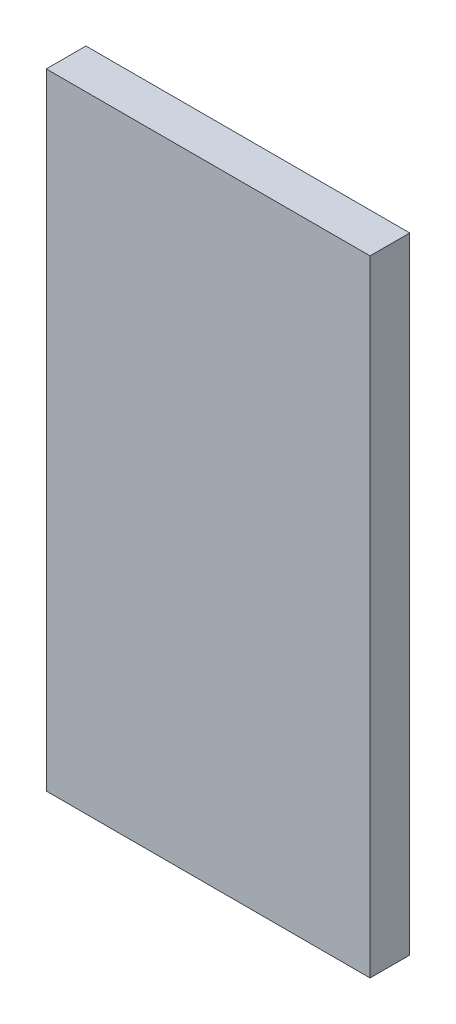
ISO-10303-21;
HEADER;
FILE_DESCRIPTION(('STEP AP214'),'2;1');
FILE_NAME('part.step','',(''),(''),'','','');
FILE_SCHEMA(('AUTOMOTIVE_DESIGN { 1 0 10303 214 1 1 1 1 }'));
ENDSEC;
DATA;
#1=APPLICATION_CONTEXT('core data for automotive mechanical design processes');
#2=APPLICATION_PROTOCOL_DEFINITION('international standard','automotive_design',2000,#1);
#3=PRODUCT_CONTEXT('',#1,'mechanical');
#4=PRODUCT('Part','Part','',(#3));
#5=PRODUCT_RELATED_PRODUCT_CATEGORY('part','',(#4));
#6=PRODUCT_DEFINITION_FORMATION('','',#4);
#7=PRODUCT_DEFINITION_CONTEXT('part definition',#1,'design');
#8=PRODUCT_DEFINITION('design','',#6,#7);
#9=PRODUCT_DEFINITION_SHAPE('','',#8);
#10=(LENGTH_UNIT() NAMED_UNIT(*) SI_UNIT(.MILLI.,.METRE.));
#11=(NAMED_UNIT(*) PLANE_ANGLE_UNIT() SI_UNIT($,.RADIAN.));
#12=(NAMED_UNIT(*) SI_UNIT($,.STERADIAN.) SOLID_ANGLE_UNIT());
#13=UNCERTAINTY_MEASURE_WITH_UNIT(LENGTH_MEASURE(1.E-05),#10,'distance_accuracy_value','');
#14=(GEOMETRIC_REPRESENTATION_CONTEXT(3) GLOBAL_UNCERTAINTY_ASSIGNED_CONTEXT((#13)) GLOBAL_UNIT_ASSIGNED_CONTEXT((#10,
#11,#12)) REPRESENTATION_CONTEXT('',''));
#15=CARTESIAN_POINT('',(0.,0.,0.));
#16=DIRECTION('',(0.,0.,1.));
#17=DIRECTION('',(1.,0.,0.));
#18=AXIS2_PLACEMENT_3D('',#15,#16,#17);
#19=CARTESIAN_POINT('',(-0.408,2.122,0.1));
#20=DIRECTION('',(0.,0.,1.));
#21=DIRECTION('',(1.,0.,0.));
#22=AXIS2_PLACEMENT_3D('',#19,#20,#21);
#23=PLANE('',#22);
#24=DIRECTION('',(0.,1.,0.));
#25=VECTOR('',#24,1.);
#26=CARTESIAN_POINT('',(0.408,2.122,0.1));
#27=LINE('',#26,#25);
#28=CARTESIAN_POINT('',(0.408,3.698,0.1));
#29=VERTEX_POINT('',#28);
#30=CARTESIAN_POINT('',(0.408,2.122,0.1));
#31=VERTEX_POINT('',#30);
#32=EDGE_CURVE('E75',#29,#31,#27,.F.);
#33=ORIENTED_EDGE('',*,*,#32,.F.);
#34=DIRECTION('',(1.,0.,0.));
#35=VECTOR('',#34,1.);
#36=CARTESIAN_POINT('',(-0.408,3.698,0.1));
#37=LINE('',#36,#35);
#38=CARTESIAN_POINT('',(-0.408,3.698,0.1));
#39=VERTEX_POINT('',#38);
#40=EDGE_CURVE('E57',#39,#29,#37,.T.);
#41=ORIENTED_EDGE('',*,*,#40,.F.);
#42=DIRECTION('',(0.,1.,0.));
#43=VECTOR('',#42,1.);
#44=CARTESIAN_POINT('',(-0.408,2.122,0.1));
#45=LINE('',#44,#43);
#46=CARTESIAN_POINT('',(-0.408,2.122,0.1));
#47=VERTEX_POINT('',#46);
#48=EDGE_CURVE('E19',#39,#47,#45,.F.);
#49=ORIENTED_EDGE('',*,*,#48,.T.);
#50=DIRECTION('',(1.,0.,0.));
#51=VECTOR('',#50,1.);
#52=CARTESIAN_POINT('',(-0.408,2.122,0.1));
#53=LINE('',#52,#51);
#54=EDGE_CURVE('E54',#47,#31,#53,.T.);
#55=ORIENTED_EDGE('',*,*,#54,.T.);
#56=EDGE_LOOP('',(#33,#41,#49,#55));
#57=FACE_BOUND('',#56,.T.);
#58=ADVANCED_FACE('F16',(#57),#23,.T.);
#59=CARTESIAN_POINT('',(-0.408,2.122,0.));
#60=DIRECTION('',(1.,0.,0.));
#61=DIRECTION('',(0.,0.,-1.));
#62=AXIS2_PLACEMENT_3D('',#59,#60,#61);
#63=PLANE('',#62);
#64=DIRECTION('',(0.,0.,1.));
#65=VECTOR('',#64,1.);
#66=CARTESIAN_POINT('',(-0.408,3.698,0.));
#67=LINE('',#66,#65);
#68=CARTESIAN_POINT('',(-0.408,3.698,0.));
#69=VERTEX_POINT('',#68);
#70=EDGE_CURVE('E77',#69,#39,#67,.T.);
#71=ORIENTED_EDGE('',*,*,#70,.F.);
#72=DIRECTION('',(0.,1.,0.));
#73=VECTOR('',#72,1.);
#74=CARTESIAN_POINT('',(-0.408,2.122,0.));
#75=LINE('',#74,#73);
#76=CARTESIAN_POINT('',(-0.408,2.122,0.));
#77=VERTEX_POINT('',#76);
#78=EDGE_CURVE('E72',#69,#77,#75,.F.);
#79=ORIENTED_EDGE('',*,*,#78,.T.);
#80=DIRECTION('',(0.,0.,1.));
#81=VECTOR('',#80,1.);
#82=CARTESIAN_POINT('',(-0.408,2.122,0.));
#83=LINE('',#82,#81);
#84=EDGE_CURVE('E62',#77,#47,#83,.T.);
#85=ORIENTED_EDGE('',*,*,#84,.T.);
#86=ORIENTED_EDGE('',*,*,#48,.F.);
#87=EDGE_LOOP('',(#71,#79,#85,#86));
#88=FACE_BOUND('',#87,.T.);
#89=ADVANCED_FACE('F71',(#88),#63,.F.);
#90=CARTESIAN_POINT('',(-0.408,2.122,0.));
#91=DIRECTION('',(0.,1.,0.));
#92=DIRECTION('',(0.,0.,1.));
#93=AXIS2_PLACEMENT_3D('',#90,#91,#92);
#94=PLANE('',#93);
#95=ORIENTED_EDGE('',*,*,#54,.F.);
#96=ORIENTED_EDGE('',*,*,#84,.F.);
#97=DIRECTION('',(1.,0.,0.));
#98=VECTOR('',#97,1.);
#99=CARTESIAN_POINT('',(-0.408,2.122,0.));
#100=LINE('',#99,#98);
#101=CARTESIAN_POINT('',(0.408,2.122,0.));
#102=VERTEX_POINT('',#101);
#103=EDGE_CURVE('E82',#77,#102,#100,.T.);
#104=ORIENTED_EDGE('',*,*,#103,.T.);
#105=DIRECTION('',(0.,0.,-1.));
#106=VECTOR('',#105,1.);
#107=CARTESIAN_POINT('',(0.408,2.122,0.));
#108=LINE('',#107,#106);
#109=EDGE_CURVE('E68',#31,#102,#108,.T.);
#110=ORIENTED_EDGE('',*,*,#109,.F.);
#111=EDGE_LOOP('',(#95,#96,#104,#110));
#112=FACE_BOUND('',#111,.T.);
#113=ADVANCED_FACE('F65',(#112),#94,.F.);
#114=CARTESIAN_POINT('',(0.408,2.122,0.));
#115=DIRECTION('',(1.,0.,0.));
#116=DIRECTION('',(0.,0.,-1.));
#117=AXIS2_PLACEMENT_3D('',#114,#115,#116);
#118=PLANE('',#117);
#119=DIRECTION('',(0.,0.,1.));
#120=VECTOR('',#119,1.);
#121=CARTESIAN_POINT('',(0.408,3.698,0.));
#122=LINE('',#121,#120);
#123=CARTESIAN_POINT('',(0.408,3.698,0.));
#124=VERTEX_POINT('',#123);
#125=EDGE_CURVE('E33',#29,#124,#122,.F.);
#126=ORIENTED_EDGE('',*,*,#125,.F.);
#127=ORIENTED_EDGE('',*,*,#32,.T.);
#128=ORIENTED_EDGE('',*,*,#109,.T.);
#129=DIRECTION('',(0.,1.,0.));
#130=VECTOR('',#129,1.);
#131=CARTESIAN_POINT('',(0.408,2.122,0.));
#132=LINE('',#131,#130);
#133=EDGE_CURVE('E25',#102,#124,#132,.T.);
#134=ORIENTED_EDGE('',*,*,#133,.T.);
#135=EDGE_LOOP('',(#126,#127,#128,#134));
#136=FACE_BOUND('',#135,.T.);
#137=ADVANCED_FACE('F87',(#136),#118,.T.);
#138=CARTESIAN_POINT('',(-0.408,3.698,0.));
#139=DIRECTION('',(0.,1.,0.));
#140=DIRECTION('',(0.,0.,1.));
#141=AXIS2_PLACEMENT_3D('',#138,#139,#140);
#142=PLANE('',#141);
#143=ORIENTED_EDGE('',*,*,#40,.T.);
#144=ORIENTED_EDGE('',*,*,#125,.T.);
#145=DIRECTION('',(1.,0.,0.));
#146=VECTOR('',#145,1.);
#147=CARTESIAN_POINT('',(-0.408,3.698,0.));
#148=LINE('',#147,#146);
#149=EDGE_CURVE('E11',#124,#69,#148,.F.);
#150=ORIENTED_EDGE('',*,*,#149,.T.);
#151=ORIENTED_EDGE('',*,*,#70,.T.);
#152=EDGE_LOOP('',(#143,#144,#150,#151));
#153=FACE_BOUND('',#152,.T.);
#154=ADVANCED_FACE('F90',(#153),#142,.T.);
#155=CARTESIAN_POINT('',(-0.408,2.122,0.));
#156=DIRECTION('',(0.,0.,1.));
#157=DIRECTION('',(1.,0.,0.));
#158=AXIS2_PLACEMENT_3D('',#155,#156,#157);
#159=PLANE('',#158);
#160=ORIENTED_EDGE('',*,*,#133,.F.);
#161=ORIENTED_EDGE('',*,*,#103,.F.);
#162=ORIENTED_EDGE('',*,*,#78,.F.);
#163=ORIENTED_EDGE('',*,*,#149,.F.);
#164=EDGE_LOOP('',(#160,#161,#162,#163));
#165=FACE_BOUND('',#164,.T.);
#166=ADVANCED_FACE('F89',(#165),#159,.F.);
#167=CLOSED_SHELL('',(#58,#89,#113,#137,#154,#166));
#168=MANIFOLD_SOLID_BREP('B1',#167);
#169=ADVANCED_BREP_SHAPE_REPRESENTATION('',(#18,#168),#14);
#170=SHAPE_DEFINITION_REPRESENTATION(#9,#169);
ENDSEC;
END-ISO-10303-21;
